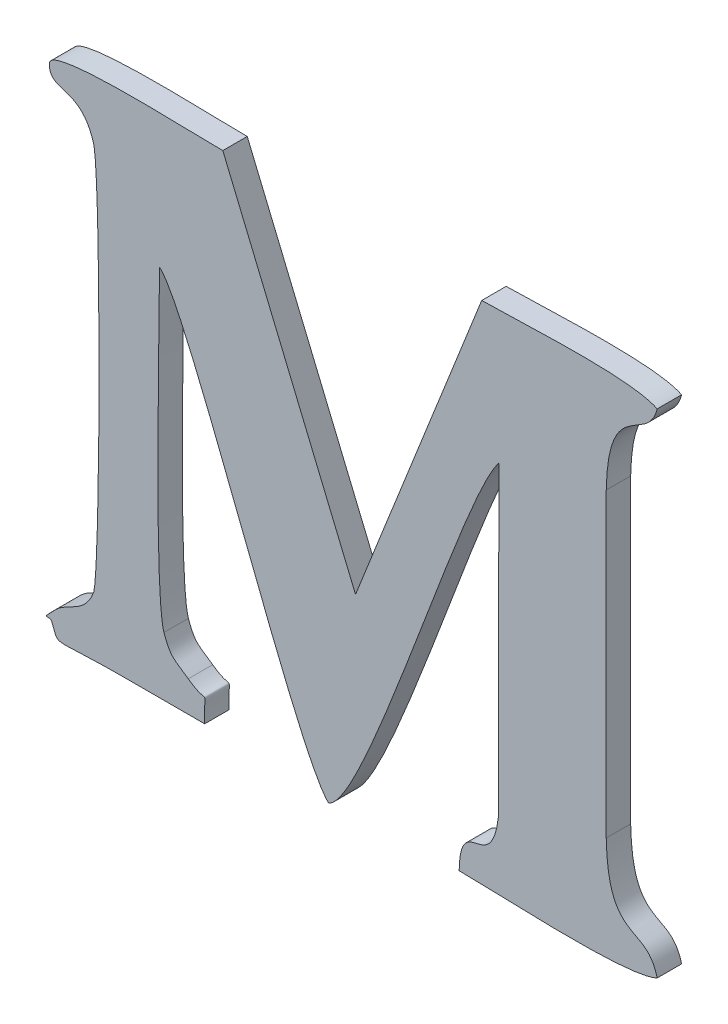
ISO-10303-21;
HEADER;
FILE_DESCRIPTION(('STEP AP214'),'2;1');
FILE_NAME('part.step','',(''),(''),'','','');
FILE_SCHEMA(('AUTOMOTIVE_DESIGN { 1 0 10303 214 1 1 1 1 }'));
ENDSEC;
DATA;
#1=APPLICATION_CONTEXT('core data for automotive mechanical design processes');
#2=APPLICATION_PROTOCOL_DEFINITION('international standard','automotive_design',2000,#1);
#3=PRODUCT_CONTEXT('',#1,'mechanical');
#4=PRODUCT('Part','Part','',(#3));
#5=PRODUCT_RELATED_PRODUCT_CATEGORY('part','',(#4));
#6=PRODUCT_DEFINITION_FORMATION('','',#4);
#7=PRODUCT_DEFINITION_CONTEXT('part definition',#1,'design');
#8=PRODUCT_DEFINITION('design','',#6,#7);
#9=PRODUCT_DEFINITION_SHAPE('','',#8);
#10=(LENGTH_UNIT() NAMED_UNIT(*) SI_UNIT(.MILLI.,.METRE.));
#11=(NAMED_UNIT(*) PLANE_ANGLE_UNIT() SI_UNIT($,.RADIAN.));
#12=(NAMED_UNIT(*) SI_UNIT($,.STERADIAN.) SOLID_ANGLE_UNIT());
#13=UNCERTAINTY_MEASURE_WITH_UNIT(LENGTH_MEASURE(1.E-05),#10,'distance_accuracy_value','');
#14=(GEOMETRIC_REPRESENTATION_CONTEXT(3) GLOBAL_UNCERTAINTY_ASSIGNED_CONTEXT((#13)) GLOBAL_UNIT_ASSIGNED_CONTEXT((#10,
#11,#12)) REPRESENTATION_CONTEXT('',''));
#15=CARTESIAN_POINT('',(0.,0.,0.));
#16=DIRECTION('',(0.,0.,1.));
#17=DIRECTION('',(1.,0.,0.));
#18=AXIS2_PLACEMENT_3D('',#15,#16,#17);
#19=CARTESIAN_POINT('',(50.2264099999998,11.201627,0.001));
#20=CARTESIAN_POINT('',(50.2264099999998,11.201627,0.));
#21=CARTESIAN_POINT('',(50.2260739999998,11.200689,0.001));
#22=CARTESIAN_POINT('',(50.2260739999998,11.200689,0.));
#23=CARTESIAN_POINT('',(50.2253459999998,11.200731,0.001));
#24=CARTESIAN_POINT('',(50.2253459999998,11.200731,0.));
#25=CARTESIAN_POINT('',(50.2248839999998,11.200269,0.001));
#26=CARTESIAN_POINT('',(50.2248839999998,11.200269,0.));
#27=B_SPLINE_SURFACE_WITH_KNOTS('',3,1,((#19,#20),(#21,#22),(#23,#24),(#25,#26)),.UNSPECIFIED.,
.F.,.F.,.F.,(4,4),(2,2),(0.863636363636364,0.909090909090909),(0.,1.),.UNSPECIFIED.);
#28=CARTESIAN_POINT('',(50.2264099999998,11.201627,0.));
#29=CARTESIAN_POINT('',(50.2260739999998,11.200689,0.));
#30=CARTESIAN_POINT('',(50.2253459999998,11.200731,0.));
#31=CARTESIAN_POINT('',(50.2248839999998,11.200269,0.));
#32=B_SPLINE_CURVE_WITH_KNOTS('',3,(#28,#29,#30,#31),.UNSPECIFIED.,.F.,.F.,(4,4),
(0.863636363636364,0.909090909090909),.UNSPECIFIED.);
#33=CARTESIAN_POINT('',(50.2264099999998,11.201627,0.));
#34=VERTEX_POINT('',#33);
#35=CARTESIAN_POINT('',(50.2248839999998,11.200269,0.));
#36=VERTEX_POINT('',#35);
#37=EDGE_CURVE('E11',#34,#36,#32,.T.);
#38=DIRECTION('',(0.,0.,-1.));
#39=VECTOR('',#38,1.);
#40=CARTESIAN_POINT('',(50.2248839999998,11.200269,0.001));
#41=LINE('',#40,#39);
#42=CARTESIAN_POINT('',(50.2248839999998,11.200269,0.001));
#43=VERTEX_POINT('',#42);
#44=EDGE_CURVE('E28',#43,#36,#41,.T.);
#45=CARTESIAN_POINT('',(50.2264099999998,11.201627,0.001));
#46=CARTESIAN_POINT('',(50.2260739999998,11.200689,0.001));
#47=CARTESIAN_POINT('',(50.2253459999998,11.200731,0.001));
#48=CARTESIAN_POINT('',(50.2248839999998,11.200269,0.001));
#49=B_SPLINE_CURVE_WITH_KNOTS('',3,(#45,#46,#47,#48),.UNSPECIFIED.,.F.,.F.,(4,4),
(0.863636363636364,0.909090909090909),.UNSPECIFIED.);
#50=CARTESIAN_POINT('',(50.2264099999998,11.201627,0.001));
#51=VERTEX_POINT('',#50);
#52=EDGE_CURVE('E477',#51,#43,#49,.T.);
#53=DIRECTION('',(0.,0.,-1.));
#54=VECTOR('',#53,1.);
#55=CARTESIAN_POINT('',(50.2264099999998,11.201627,0.001));
#56=LINE('',#55,#54);
#57=EDGE_CURVE('E40',#51,#34,#56,.T.);
#58=ORIENTED_EDGE('',*,*,#37,.T.);
#59=ORIENTED_EDGE('',*,*,#44,.F.);
#60=ORIENTED_EDGE('',*,*,#52,.F.);
#61=ORIENTED_EDGE('',*,*,#57,.T.);
#62=EDGE_LOOP('',(#58,#59,#60,#61));
#63=FACE_BOUND('',#62,.T.);
#64=ADVANCED_FACE('F17',(#63),#27,.F.);
#65=CARTESIAN_POINT('',(50.2248839999998,11.200269,0.001));
#66=CARTESIAN_POINT('',(50.2248839999998,11.200269,0.));
#67=CARTESIAN_POINT('',(50.2241559999998,11.199555,0.001));
#68=CARTESIAN_POINT('',(50.2241559999998,11.199555,0.));
#69=CARTESIAN_POINT('',(50.2246179999998,11.199961,0.001));
#70=CARTESIAN_POINT('',(50.2246179999998,11.199961,0.));
#71=CARTESIAN_POINT('',(50.2247019999998,11.199737,0.001));
#72=CARTESIAN_POINT('',(50.2247019999998,11.199737,0.));
#73=B_SPLINE_SURFACE_WITH_KNOTS('',3,1,((#65,#66),(#67,#68),(#69,#70),(#71,#72)),.UNSPECIFIED.,
.F.,.F.,.F.,(4,4),(2,2),(0.909090909090909,1.),(0.,1.),.UNSPECIFIED.);
#74=CARTESIAN_POINT('',(50.2248839999998,11.200269,0.));
#75=CARTESIAN_POINT('',(50.2241559999998,11.199555,0.));
#76=CARTESIAN_POINT('',(50.2246179999998,11.199961,0.));
#77=CARTESIAN_POINT('',(50.2247019999998,11.199737,0.));
#78=B_SPLINE_CURVE_WITH_KNOTS('',3,(#74,#75,#76,#77),.UNSPECIFIED.,.F.,.F.,(4,4),
(0.909090909090909,1.),.UNSPECIFIED.);
#79=CARTESIAN_POINT('',(50.2247019999998,11.199737,0.));
#80=VERTEX_POINT('',#79);
#81=EDGE_CURVE('E469',#36,#80,#78,.T.);
#82=DIRECTION('',(0.,0.,-1.));
#83=VECTOR('',#82,1.);
#84=CARTESIAN_POINT('',(50.2247019999998,11.199737,0.001));
#85=LINE('',#84,#83);
#86=CARTESIAN_POINT('',(50.2247019999998,11.199737,0.001));
#87=VERTEX_POINT('',#86);
#88=EDGE_CURVE('E464',#87,#80,#85,.T.);
#89=CARTESIAN_POINT('',(50.2248839999998,11.200269,0.001));
#90=CARTESIAN_POINT('',(50.2241559999998,11.199555,0.001));
#91=CARTESIAN_POINT('',(50.2246179999998,11.199961,0.001));
#92=CARTESIAN_POINT('',(50.2247019999998,11.199737,0.001));
#93=B_SPLINE_CURVE_WITH_KNOTS('',3,(#89,#90,#91,#92),.UNSPECIFIED.,.F.,.F.,(4,4),
(0.909090909090909,1.),.UNSPECIFIED.);
#94=EDGE_CURVE('E457',#43,#87,#93,.T.);
#95=ORIENTED_EDGE('',*,*,#81,.T.);
#96=ORIENTED_EDGE('',*,*,#88,.F.);
#97=ORIENTED_EDGE('',*,*,#94,.F.);
#98=ORIENTED_EDGE('',*,*,#44,.T.);
#99=EDGE_LOOP('',(#95,#96,#97,#98));
#100=FACE_BOUND('',#99,.T.);
#101=ADVANCED_FACE('F485',(#100),#73,.F.);
#102=CARTESIAN_POINT('',(50.2247019999998,11.199737,0.001));
#103=CARTESIAN_POINT('',(50.2247019999998,11.199737,0.));
#104=CARTESIAN_POINT('',(50.2250239999998,11.198939,0.001));
#105=CARTESIAN_POINT('',(50.2250239999998,11.198939,0.));
#106=CARTESIAN_POINT('',(50.2246319999998,11.199233,0.001));
#107=CARTESIAN_POINT('',(50.2246319999998,11.199233,0.));
#108=CARTESIAN_POINT('',(50.2274879999998,11.199247,0.001));
#109=CARTESIAN_POINT('',(50.2274879999998,11.199247,0.));
#110=B_SPLINE_SURFACE_WITH_KNOTS('',3,1,((#102,#103),(#104,#105),(#106,#107),(#108,#109)),
.UNSPECIFIED.,.F.,.F.,.F.,(4,4),(2,2),(0.,0.0454545454545455),(0.,1.),.UNSPECIFIED.);
#111=CARTESIAN_POINT('',(50.2247019999998,11.199737,0.));
#112=CARTESIAN_POINT('',(50.2250239999998,11.198939,0.));
#113=CARTESIAN_POINT('',(50.2246319999998,11.199233,0.));
#114=CARTESIAN_POINT('',(50.2274879999998,11.199247,0.));
#115=B_SPLINE_CURVE_WITH_KNOTS('',3,(#111,#112,#113,#114),.UNSPECIFIED.,.F.,.F.,(4,4),(0.,
0.0454545454545455),.UNSPECIFIED.);
#116=CARTESIAN_POINT('',(50.2274879999998,11.199247,0.));
#117=VERTEX_POINT('',#116);
#118=EDGE_CURVE('E452',#80,#117,#115,.T.);
#119=DIRECTION('',(0.,0.,-1.));
#120=VECTOR('',#119,1.);
#121=CARTESIAN_POINT('',(50.2274879999998,11.199247,0.001));
#122=LINE('',#121,#120);
#123=CARTESIAN_POINT('',(50.2274879999998,11.199247,0.001));
#124=VERTEX_POINT('',#123);
#125=EDGE_CURVE('E447',#124,#117,#122,.T.);
#126=CARTESIAN_POINT('',(50.2247019999998,11.199737,0.001));
#127=CARTESIAN_POINT('',(50.2250239999998,11.198939,0.001));
#128=CARTESIAN_POINT('',(50.2246319999998,11.199233,0.001));
#129=CARTESIAN_POINT('',(50.2274879999998,11.199247,0.001));
#130=B_SPLINE_CURVE_WITH_KNOTS('',3,(#126,#127,#128,#129),.UNSPECIFIED.,.F.,.F.,(4,4),(0.,
0.0454545454545455),.UNSPECIFIED.);
#131=EDGE_CURVE('E440',#87,#124,#130,.T.);
#132=ORIENTED_EDGE('',*,*,#118,.T.);
#133=ORIENTED_EDGE('',*,*,#125,.F.);
#134=ORIENTED_EDGE('',*,*,#131,.F.);
#135=ORIENTED_EDGE('',*,*,#88,.T.);
#136=EDGE_LOOP('',(#132,#133,#134,#135));
#137=FACE_BOUND('',#136,.T.);
#138=ADVANCED_FACE('F490',(#137),#110,.F.);
#139=CARTESIAN_POINT('',(50.2274879999998,11.199247,0.001));
#140=CARTESIAN_POINT('',(50.2274879999998,11.199247,0.));
#141=CARTESIAN_POINT('',(50.2286359999998,11.199261,0.001));
#142=CARTESIAN_POINT('',(50.2286359999998,11.199261,0.));
#143=CARTESIAN_POINT('',(50.2297979999998,11.199247,0.001));
#144=CARTESIAN_POINT('',(50.2297979999998,11.199247,0.));
#145=CARTESIAN_POINT('',(50.2309599999998,11.199247,0.001));
#146=CARTESIAN_POINT('',(50.2309599999998,11.199247,0.));
#147=B_SPLINE_SURFACE_WITH_KNOTS('',3,1,((#139,#140),(#141,#142),(#143,#144),(#145,#146)),
.UNSPECIFIED.,.F.,.F.,.F.,(4,4),(2,2),(0.0454545454545455,0.0909090909090909),(0.,1.),.UNSPECIFIED.);
#148=CARTESIAN_POINT('',(50.2274879999998,11.199247,0.));
#149=CARTESIAN_POINT('',(50.2286359999998,11.199261,0.));
#150=CARTESIAN_POINT('',(50.2297979999998,11.199247,0.));
#151=CARTESIAN_POINT('',(50.2309599999998,11.199247,0.));
#152=B_SPLINE_CURVE_WITH_KNOTS('',3,(#148,#149,#150,#151),.UNSPECIFIED.,.F.,.F.,(4,4),
(0.0454545454545455,0.0909090909090909),.UNSPECIFIED.);
#153=CARTESIAN_POINT('',(50.2309599999998,11.199247,0.));
#154=VERTEX_POINT('',#153);
#155=EDGE_CURVE('E435',#117,#154,#152,.T.);
#156=DIRECTION('',(0.,0.,-1.));
#157=VECTOR('',#156,1.);
#158=CARTESIAN_POINT('',(50.2309599999998,11.199247,0.001));
#159=LINE('',#158,#157);
#160=CARTESIAN_POINT('',(50.2309599999998,11.199247,0.001));
#161=VERTEX_POINT('',#160);
#162=EDGE_CURVE('E430',#161,#154,#159,.T.);
#163=CARTESIAN_POINT('',(50.2274879999998,11.199247,0.001));
#164=CARTESIAN_POINT('',(50.2286359999998,11.199261,0.001));
#165=CARTESIAN_POINT('',(50.2297979999998,11.199247,0.001));
#166=CARTESIAN_POINT('',(50.2309599999998,11.199247,0.001));
#167=B_SPLINE_CURVE_WITH_KNOTS('',3,(#163,#164,#165,#166),.UNSPECIFIED.,.F.,.F.,(4,4),
(0.0454545454545455,0.0909090909090909),.UNSPECIFIED.);
#168=EDGE_CURVE('E423',#124,#161,#167,.T.);
#169=ORIENTED_EDGE('',*,*,#155,.T.);
#170=ORIENTED_EDGE('',*,*,#162,.F.);
#171=ORIENTED_EDGE('',*,*,#168,.F.);
#172=ORIENTED_EDGE('',*,*,#125,.T.);
#173=EDGE_LOOP('',(#169,#170,#171,#172));
#174=FACE_BOUND('',#173,.T.);
#175=ADVANCED_FACE('F496',(#174),#147,.F.);
#176=CARTESIAN_POINT('',(50.2309599999998,11.199247,0.001));
#177=CARTESIAN_POINT('',(50.2309599999998,11.199247,0.));
#178=CARTESIAN_POINT('',(50.2309179999998,11.200717,0.001));
#179=CARTESIAN_POINT('',(50.2309179999998,11.200717,0.));
#180=CARTESIAN_POINT('',(50.2311979999998,11.199849,0.001));
#181=CARTESIAN_POINT('',(50.2311979999998,11.199849,0.));
#182=CARTESIAN_POINT('',(50.2302879999998,11.200507,0.001));
#183=CARTESIAN_POINT('',(50.2302879999998,11.200507,0.));
#184=B_SPLINE_SURFACE_WITH_KNOTS('',3,1,((#176,#177),(#178,#179),(#180,#181),(#182,#183)),
.UNSPECIFIED.,.F.,.F.,.F.,(4,4),(2,2),(0.0909090909090909,0.136363636363636),(0.,1.),.UNSPECIFIED.);
#185=CARTESIAN_POINT('',(50.2309599999998,11.199247,0.));
#186=CARTESIAN_POINT('',(50.2309179999998,11.200717,0.));
#187=CARTESIAN_POINT('',(50.2311979999998,11.199849,0.));
#188=CARTESIAN_POINT('',(50.2302879999998,11.200507,0.));
#189=B_SPLINE_CURVE_WITH_KNOTS('',3,(#185,#186,#187,#188),.UNSPECIFIED.,.F.,.F.,(4,4),
(0.0909090909090909,0.136363636363636),.UNSPECIFIED.);
#190=CARTESIAN_POINT('',(50.2302879999998,11.200507,0.));
#191=VERTEX_POINT('',#190);
#192=EDGE_CURVE('E418',#154,#191,#189,.T.);
#193=DIRECTION('',(0.,0.,-1.));
#194=VECTOR('',#193,1.);
#195=CARTESIAN_POINT('',(50.2302879999998,11.200507,0.001));
#196=LINE('',#195,#194);
#197=CARTESIAN_POINT('',(50.2302879999998,11.200507,0.001));
#198=VERTEX_POINT('',#197);
#199=EDGE_CURVE('E413',#198,#191,#196,.T.);
#200=CARTESIAN_POINT('',(50.2309599999998,11.199247,0.001));
#201=CARTESIAN_POINT('',(50.2309179999998,11.200717,0.001));
#202=CARTESIAN_POINT('',(50.2311979999998,11.199849,0.001));
#203=CARTESIAN_POINT('',(50.2302879999998,11.200507,0.001));
#204=B_SPLINE_CURVE_WITH_KNOTS('',3,(#200,#201,#202,#203),.UNSPECIFIED.,.F.,.F.,(4,4),
(0.0909090909090909,0.136363636363636),.UNSPECIFIED.);
#205=EDGE_CURVE('E406',#161,#198,#204,.T.);
#206=ORIENTED_EDGE('',*,*,#192,.T.);
#207=ORIENTED_EDGE('',*,*,#199,.F.);
#208=ORIENTED_EDGE('',*,*,#205,.F.);
#209=ORIENTED_EDGE('',*,*,#162,.T.);
#210=EDGE_LOOP('',(#206,#207,#208,#209));
#211=FACE_BOUND('',#210,.T.);
#212=ADVANCED_FACE('F500',(#211),#184,.F.);
#213=CARTESIAN_POINT('',(50.2302879999998,11.200507,0.001));
#214=CARTESIAN_POINT('',(50.2302879999998,11.200507,0.));
#215=CARTESIAN_POINT('',(50.2297279999998,11.200913,0.001));
#216=CARTESIAN_POINT('',(50.2297279999998,11.200913,0.));
#217=CARTESIAN_POINT('',(50.2295599999998,11.200885,0.001));
#218=CARTESIAN_POINT('',(50.2295599999998,11.200885,0.));
#219=CARTESIAN_POINT('',(50.2292939999998,11.201655,0.001));
#220=CARTESIAN_POINT('',(50.2292939999998,11.201655,0.));
#221=B_SPLINE_SURFACE_WITH_KNOTS('',3,1,((#213,#214),(#215,#216),(#217,#218),(#219,#220)),
.UNSPECIFIED.,.F.,.F.,.F.,(4,4),(2,2),(0.136363636363636,0.181818181818182),(0.,1.),.UNSPECIFIED.);
#222=CARTESIAN_POINT('',(50.2302879999998,11.200507,0.));
#223=CARTESIAN_POINT('',(50.2297279999998,11.200913,0.));
#224=CARTESIAN_POINT('',(50.2295599999998,11.200885,0.));
#225=CARTESIAN_POINT('',(50.2292939999998,11.201655,0.));
#226=B_SPLINE_CURVE_WITH_KNOTS('',3,(#222,#223,#224,#225),.UNSPECIFIED.,.F.,.F.,(4,4),
(0.136363636363636,0.181818181818182),.UNSPECIFIED.);
#227=CARTESIAN_POINT('',(50.2292939999998,11.201655,0.));
#228=VERTEX_POINT('',#227);
#229=EDGE_CURVE('E401',#191,#228,#226,.T.);
#230=DIRECTION('',(0.,0.,-1.));
#231=VECTOR('',#230,1.);
#232=CARTESIAN_POINT('',(50.2292939999998,11.201655,0.001));
#233=LINE('',#232,#231);
#234=CARTESIAN_POINT('',(50.2292939999998,11.201655,0.001));
#235=VERTEX_POINT('',#234);
#236=EDGE_CURVE('E396',#235,#228,#233,.T.);
#237=CARTESIAN_POINT('',(50.2302879999998,11.200507,0.001));
#238=CARTESIAN_POINT('',(50.2297279999998,11.200913,0.001));
#239=CARTESIAN_POINT('',(50.2295599999998,11.200885,0.001));
#240=CARTESIAN_POINT('',(50.2292939999998,11.201655,0.001));
#241=B_SPLINE_CURVE_WITH_KNOTS('',3,(#237,#238,#239,#240),.UNSPECIFIED.,.F.,.F.,(4,4),
(0.136363636363636,0.181818181818182),.UNSPECIFIED.);
#242=EDGE_CURVE('E389',#198,#235,#241,.T.);
#243=ORIENTED_EDGE('',*,*,#229,.T.);
#244=ORIENTED_EDGE('',*,*,#236,.F.);
#245=ORIENTED_EDGE('',*,*,#242,.F.);
#246=ORIENTED_EDGE('',*,*,#199,.T.);
#247=EDGE_LOOP('',(#243,#244,#245,#246));
#248=FACE_BOUND('',#247,.T.);
#249=ADVANCED_FACE('F505',(#248),#221,.F.);
#250=CARTESIAN_POINT('',(50.2292939999998,11.201655,0.001));
#251=CARTESIAN_POINT('',(50.2292939999998,11.201655,0.));
#252=CARTESIAN_POINT('',(50.2288739999998,11.202859,0.001));
#253=CARTESIAN_POINT('',(50.2288739999998,11.202859,0.));
#254=CARTESIAN_POINT('',(50.2291119999998,11.212771,0.001));
#255=CARTESIAN_POINT('',(50.2291119999998,11.212771,0.));
#256=CARTESIAN_POINT('',(50.2291119999998,11.214507,0.001));
#257=CARTESIAN_POINT('',(50.2291119999998,11.214507,0.));
#258=B_SPLINE_SURFACE_WITH_KNOTS('',3,1,((#250,#251),(#252,#253),(#254,#255),(#256,#257)),
.UNSPECIFIED.,.F.,.F.,.F.,(4,4),(2,2),(0.181818181818182,0.227272727272727),(0.,1.),.UNSPECIFIED.);
#259=CARTESIAN_POINT('',(50.2292939999998,11.201655,0.));
#260=CARTESIAN_POINT('',(50.2288739999998,11.202859,0.));
#261=CARTESIAN_POINT('',(50.2291119999998,11.212771,0.));
#262=CARTESIAN_POINT('',(50.2291119999998,11.214507,0.));
#263=B_SPLINE_CURVE_WITH_KNOTS('',3,(#259,#260,#261,#262),.UNSPECIFIED.,.F.,.F.,(4,4),
(0.181818181818182,0.227272727272727),.UNSPECIFIED.);
#264=CARTESIAN_POINT('',(50.2291119999998,11.214507,0.));
#265=VERTEX_POINT('',#264);
#266=EDGE_CURVE('E384',#228,#265,#263,.T.);
#267=DIRECTION('',(0.,0.,-1.));
#268=VECTOR('',#267,1.);
#269=CARTESIAN_POINT('',(50.2291119999998,11.214507,0.001));
#270=LINE('',#269,#268);
#271=CARTESIAN_POINT('',(50.2291119999998,11.214507,0.001));
#272=VERTEX_POINT('',#271);
#273=EDGE_CURVE('E379',#272,#265,#270,.T.);
#274=CARTESIAN_POINT('',(50.2292939999998,11.201655,0.001));
#275=CARTESIAN_POINT('',(50.2288739999998,11.202859,0.001));
#276=CARTESIAN_POINT('',(50.2291119999998,11.212771,0.001));
#277=CARTESIAN_POINT('',(50.2291119999998,11.214507,0.001));
#278=B_SPLINE_CURVE_WITH_KNOTS('',3,(#274,#275,#276,#277),.UNSPECIFIED.,.F.,.F.,(4,4),
(0.181818181818182,0.227272727272727),.UNSPECIFIED.);
#279=EDGE_CURVE('E372',#235,#272,#278,.T.);
#280=ORIENTED_EDGE('',*,*,#266,.T.);
#281=ORIENTED_EDGE('',*,*,#273,.F.);
#282=ORIENTED_EDGE('',*,*,#279,.F.);
#283=ORIENTED_EDGE('',*,*,#236,.T.);
#284=EDGE_LOOP('',(#280,#281,#282,#283));
#285=FACE_BOUND('',#284,.T.);
#286=ADVANCED_FACE('F511',(#285),#258,.F.);
#287=CARTESIAN_POINT('',(50.2291119999998,11.214507,0.001));
#288=CARTESIAN_POINT('',(50.2291119999998,11.214507,0.));
#289=CARTESIAN_POINT('',(50.2303019999998,11.213597,0.001));
#290=CARTESIAN_POINT('',(50.2303019999998,11.213597,0.));
#291=CARTESIAN_POINT('',(50.2346979999998,11.200157,0.001));
#292=CARTESIAN_POINT('',(50.2346979999998,11.200157,0.));
#293=CARTESIAN_POINT('',(50.2360279999998,11.198981,0.001));
#294=CARTESIAN_POINT('',(50.2360279999998,11.198981,0.));
#295=B_SPLINE_SURFACE_WITH_KNOTS('',3,1,((#287,#288),(#289,#290),(#291,#292),(#293,#294)),
.UNSPECIFIED.,.F.,.F.,.F.,(4,4),(2,2),(0.227272727272727,0.272727272727273),(0.,1.),.UNSPECIFIED.);
#296=CARTESIAN_POINT('',(50.2291119999998,11.214507,0.));
#297=CARTESIAN_POINT('',(50.2303019999998,11.213597,0.));
#298=CARTESIAN_POINT('',(50.2346979999998,11.200157,0.));
#299=CARTESIAN_POINT('',(50.2360279999998,11.198981,0.));
#300=B_SPLINE_CURVE_WITH_KNOTS('',3,(#296,#297,#298,#299),.UNSPECIFIED.,.F.,.F.,(4,4),
(0.227272727272727,0.272727272727273),.UNSPECIFIED.);
#301=CARTESIAN_POINT('',(50.2360279999998,11.198981,0.));
#302=VERTEX_POINT('',#301);
#303=EDGE_CURVE('E367',#265,#302,#300,.T.);
#304=DIRECTION('',(0.,0.,-1.));
#305=VECTOR('',#304,1.);
#306=CARTESIAN_POINT('',(50.2360279999998,11.198981,0.001));
#307=LINE('',#306,#305);
#308=CARTESIAN_POINT('',(50.2360279999998,11.198981,0.001));
#309=VERTEX_POINT('',#308);
#310=EDGE_CURVE('E362',#309,#302,#307,.T.);
#311=CARTESIAN_POINT('',(50.2291119999998,11.214507,0.001));
#312=CARTESIAN_POINT('',(50.2303019999998,11.213597,0.001));
#313=CARTESIAN_POINT('',(50.2346979999998,11.200157,0.001));
#314=CARTESIAN_POINT('',(50.2360279999998,11.198981,0.001));
#315=B_SPLINE_CURVE_WITH_KNOTS('',3,(#311,#312,#313,#314),.UNSPECIFIED.,.F.,.F.,(4,4),
(0.227272727272727,0.272727272727273),.UNSPECIFIED.);
#316=EDGE_CURVE('E355',#272,#309,#315,.T.);
#317=ORIENTED_EDGE('',*,*,#303,.T.);
#318=ORIENTED_EDGE('',*,*,#310,.F.);
#319=ORIENTED_EDGE('',*,*,#316,.F.);
#320=ORIENTED_EDGE('',*,*,#273,.T.);
#321=EDGE_LOOP('',(#317,#318,#319,#320));
#322=FACE_BOUND('',#321,.T.);
#323=ADVANCED_FACE('F515',(#322),#295,.F.);
#324=CARTESIAN_POINT('',(50.2360279999998,11.198981,0.001));
#325=CARTESIAN_POINT('',(50.2360279999998,11.198981,0.));
#326=CARTESIAN_POINT('',(50.2374979999998,11.199471,0.001));
#327=CARTESIAN_POINT('',(50.2374979999998,11.199471,0.));
#328=CARTESIAN_POINT('',(50.2415439999998,11.212757,0.001));
#329=CARTESIAN_POINT('',(50.2415439999998,11.212757,0.));
#330=CARTESIAN_POINT('',(50.2429999999998,11.214507,0.001));
#331=CARTESIAN_POINT('',(50.2429999999998,11.214507,0.));
#332=B_SPLINE_SURFACE_WITH_KNOTS('',3,1,((#324,#325),(#326,#327),(#328,#329),(#330,#331)),
.UNSPECIFIED.,.F.,.F.,.F.,(4,4),(2,2),(0.272727272727273,0.318181818181818),(0.,1.),.UNSPECIFIED.);
#333=CARTESIAN_POINT('',(50.2360279999998,11.198981,0.));
#334=CARTESIAN_POINT('',(50.2374979999998,11.199471,0.));
#335=CARTESIAN_POINT('',(50.2415439999998,11.212757,0.));
#336=CARTESIAN_POINT('',(50.2429999999998,11.214507,0.));
#337=B_SPLINE_CURVE_WITH_KNOTS('',3,(#333,#334,#335,#336),.UNSPECIFIED.,.F.,.F.,(4,4),
(0.272727272727273,0.318181818181818),.UNSPECIFIED.);
#338=CARTESIAN_POINT('',(50.2429999999998,11.214507,0.));
#339=VERTEX_POINT('',#338);
#340=EDGE_CURVE('E350',#302,#339,#337,.T.);
#341=DIRECTION('',(0.,0.,-1.));
#342=VECTOR('',#341,1.);
#343=CARTESIAN_POINT('',(50.2429999999998,11.214507,0.001));
#344=LINE('',#343,#342);
#345=CARTESIAN_POINT('',(50.2429999999998,11.214507,0.001));
#346=VERTEX_POINT('',#345);
#347=EDGE_CURVE('E345',#346,#339,#344,.T.);
#348=CARTESIAN_POINT('',(50.2360279999998,11.198981,0.001));
#349=CARTESIAN_POINT('',(50.2374979999998,11.199471,0.001));
#350=CARTESIAN_POINT('',(50.2415439999998,11.212757,0.001));
#351=CARTESIAN_POINT('',(50.2429999999998,11.214507,0.001));
#352=B_SPLINE_CURVE_WITH_KNOTS('',3,(#348,#349,#350,#351),.UNSPECIFIED.,.F.,.F.,(4,4),
(0.272727272727273,0.318181818181818),.UNSPECIFIED.);
#353=EDGE_CURVE('E341',#309,#346,#352,.T.);
#354=ORIENTED_EDGE('',*,*,#340,.T.);
#355=ORIENTED_EDGE('',*,*,#347,.F.);
#356=ORIENTED_EDGE('',*,*,#353,.F.);
#357=ORIENTED_EDGE('',*,*,#310,.T.);
#358=EDGE_LOOP('',(#354,#355,#356,#357));
#359=FACE_BOUND('',#358,.T.);
#360=ADVANCED_FACE('F520',(#359),#332,.F.);
#361=CARTESIAN_POINT('',(50.2304071169103,-0.0561233599332541,0.001));
#362=DIRECTION('',(0.99999937580034,-0.0011173177388438,0.));
#363=DIRECTION('',(0.0011173177388438,0.99999937580034,0.));
#364=AXIS2_PLACEMENT_3D('',#361,#362,#363);
#365=PLANE('',#364);
#366=DIRECTION('',(-0.0011173177388438,-0.99999937580034,0.));
#367=VECTOR('',#366,1.);
#368=CARTESIAN_POINT('',(50.2304071169103,-0.0561233599332541,0.));
#369=LINE('',#368,#367);
#370=CARTESIAN_POINT('',(50.2429859999998,11.201977,0.));
#371=VERTEX_POINT('',#370);
#372=EDGE_CURVE('E339',#339,#371,#369,.T.);
#373=ORIENTED_EDGE('',*,*,#372,.T.);
#374=DIRECTION('',(0.,0.,-1.));
#375=VECTOR('',#374,1.);
#376=CARTESIAN_POINT('',(50.2429859999998,11.201977,0.001));
#377=LINE('',#376,#375);
#378=CARTESIAN_POINT('',(50.2429859999998,11.201977,0.001));
#379=VERTEX_POINT('',#378);
#380=EDGE_CURVE('E336',#379,#371,#377,.T.);
#381=ORIENTED_EDGE('',*,*,#380,.F.);
#382=DIRECTION('',(-0.0011173177388438,-0.99999937580034,0.));
#383=VECTOR('',#382,1.);
#384=CARTESIAN_POINT('',(50.2304071169103,-0.0561233599332541,0.001));
#385=LINE('',#384,#383);
#386=EDGE_CURVE('E330',#346,#379,#385,.T.);
#387=ORIENTED_EDGE('',*,*,#386,.F.);
#388=ORIENTED_EDGE('',*,*,#347,.T.);
#389=EDGE_LOOP('',(#373,#381,#387,#388));
#390=FACE_BOUND('',#389,.T.);
#391=ADVANCED_FACE('F565',(#390),#365,.F.);
#392=CARTESIAN_POINT('',(50.2429859999998,11.201977,0.001));
#393=CARTESIAN_POINT('',(50.2429859999998,11.201977,0.));
#394=CARTESIAN_POINT('',(50.2426919999998,11.199527,0.001));
#395=CARTESIAN_POINT('',(50.2426919999998,11.199527,0.));
#396=CARTESIAN_POINT('',(50.2414179999998,11.201585,0.001));
#397=CARTESIAN_POINT('',(50.2414179999998,11.201585,0.));
#398=CARTESIAN_POINT('',(50.2413759999998,11.199247,0.001));
#399=CARTESIAN_POINT('',(50.2413759999998,11.199247,0.));
#400=B_SPLINE_SURFACE_WITH_KNOTS('',3,1,((#392,#393),(#394,#395),(#396,#397),(#398,#399)),
.UNSPECIFIED.,.F.,.F.,.F.,(4,4),(2,2),(0.363636363636364,0.409090909090909),(0.,1.),.UNSPECIFIED.);
#401=CARTESIAN_POINT('',(50.2429859999998,11.201977,0.));
#402=CARTESIAN_POINT('',(50.2426919999998,11.199527,0.));
#403=CARTESIAN_POINT('',(50.2414179999998,11.201585,0.));
#404=CARTESIAN_POINT('',(50.2413759999998,11.199247,0.));
#405=B_SPLINE_CURVE_WITH_KNOTS('',3,(#401,#402,#403,#404),.UNSPECIFIED.,.F.,.F.,(4,4),
(0.363636363636364,0.409090909090909),.UNSPECIFIED.);
#406=CARTESIAN_POINT('',(50.2413759999998,11.199247,0.));
#407=VERTEX_POINT('',#406);
#408=EDGE_CURVE('E325',#371,#407,#405,.T.);
#409=DIRECTION('',(0.,0.,-1.));
#410=VECTOR('',#409,1.);
#411=CARTESIAN_POINT('',(50.2413759999998,11.199247,0.001));
#412=LINE('',#411,#410);
#413=CARTESIAN_POINT('',(50.2413759999998,11.199247,0.001));
#414=VERTEX_POINT('',#413);
#415=EDGE_CURVE('E320',#414,#407,#412,.T.);
#416=CARTESIAN_POINT('',(50.2429859999998,11.201977,0.001));
#417=CARTESIAN_POINT('',(50.2426919999998,11.199527,0.001));
#418=CARTESIAN_POINT('',(50.2414179999998,11.201585,0.001));
#419=CARTESIAN_POINT('',(50.2413759999998,11.199247,0.001));
#420=B_SPLINE_CURVE_WITH_KNOTS('',3,(#416,#417,#418,#419),.UNSPECIFIED.,.F.,.F.,(4,4),
(0.363636363636364,0.409090909090909),.UNSPECIFIED.);
#421=EDGE_CURVE('E313',#379,#414,#420,.T.);
#422=ORIENTED_EDGE('',*,*,#408,.T.);
#423=ORIENTED_EDGE('',*,*,#415,.F.);
#424=ORIENTED_EDGE('',*,*,#421,.F.);
#425=ORIENTED_EDGE('',*,*,#380,.T.);
#426=EDGE_LOOP('',(#422,#423,#424,#425));
#427=FACE_BOUND('',#426,.T.);
#428=ADVANCED_FACE('F526',(#427),#400,.F.);
#429=CARTESIAN_POINT('',(50.2413759999998,11.199247,0.001));
#430=CARTESIAN_POINT('',(50.2413759999998,11.199247,0.));
#431=CARTESIAN_POINT('',(50.2430839999998,11.199247,0.001));
#432=CARTESIAN_POINT('',(50.2430839999998,11.199247,0.));
#433=CARTESIAN_POINT('',(50.2482499999998,11.198897,0.001));
#434=CARTESIAN_POINT('',(50.2482499999998,11.198897,0.));
#435=CARTESIAN_POINT('',(50.2494819999998,11.199499,0.001));
#436=CARTESIAN_POINT('',(50.2494819999998,11.199499,0.));
#437=B_SPLINE_SURFACE_WITH_KNOTS('',3,1,((#429,#430),(#431,#432),(#433,#434),(#435,#436)),
.UNSPECIFIED.,.F.,.F.,.F.,(4,4),(2,2),(0.409090909090909,0.454545454545455),(0.,1.),.UNSPECIFIED.);
#438=CARTESIAN_POINT('',(50.2413759999998,11.199247,0.));
#439=CARTESIAN_POINT('',(50.2430839999998,11.199247,0.));
#440=CARTESIAN_POINT('',(50.2482499999998,11.198897,0.));
#441=CARTESIAN_POINT('',(50.2494819999998,11.199499,0.));
#442=B_SPLINE_CURVE_WITH_KNOTS('',3,(#438,#439,#440,#441),.UNSPECIFIED.,.F.,.F.,(4,4),
(0.409090909090909,0.454545454545455),.UNSPECIFIED.);
#443=CARTESIAN_POINT('',(50.2494819999998,11.199499,0.));
#444=VERTEX_POINT('',#443);
#445=EDGE_CURVE('E308',#407,#444,#442,.T.);
#446=DIRECTION('',(0.,0.,-1.));
#447=VECTOR('',#446,1.);
#448=CARTESIAN_POINT('',(50.2494819999998,11.199499,0.001));
#449=LINE('',#448,#447);
#450=CARTESIAN_POINT('',(50.2494819999998,11.199499,0.001));
#451=VERTEX_POINT('',#450);
#452=EDGE_CURVE('E303',#451,#444,#449,.T.);
#453=CARTESIAN_POINT('',(50.2413759999998,11.199247,0.001));
#454=CARTESIAN_POINT('',(50.2430839999998,11.199247,0.001));
#455=CARTESIAN_POINT('',(50.2482499999998,11.198897,0.001));
#456=CARTESIAN_POINT('',(50.2494819999998,11.199499,0.001));
#457=B_SPLINE_CURVE_WITH_KNOTS('',3,(#453,#454,#455,#456),.UNSPECIFIED.,.F.,.F.,(4,4),
(0.409090909090909,0.454545454545455),.UNSPECIFIED.);
#458=EDGE_CURVE('E296',#414,#451,#457,.T.);
#459=ORIENTED_EDGE('',*,*,#445,.T.);
#460=ORIENTED_EDGE('',*,*,#452,.F.);
#461=ORIENTED_EDGE('',*,*,#458,.F.);
#462=ORIENTED_EDGE('',*,*,#415,.T.);
#463=EDGE_LOOP('',(#459,#460,#461,#462));
#464=FACE_BOUND('',#463,.T.);
#465=ADVANCED_FACE('F532',(#464),#437,.F.);
#466=CARTESIAN_POINT('',(50.2494819999998,11.199499,0.001));
#467=CARTESIAN_POINT('',(50.2494819999998,11.199499,0.));
#468=CARTESIAN_POINT('',(50.2490339999998,11.201235,0.001));
#469=CARTESIAN_POINT('',(50.2490339999998,11.201235,0.));
#470=CARTESIAN_POINT('',(50.2474659999998,11.199751,0.001));
#471=CARTESIAN_POINT('',(50.2474659999998,11.199751,0.));
#472=CARTESIAN_POINT('',(50.2473959999998,11.203419,0.001));
#473=CARTESIAN_POINT('',(50.2473959999998,11.203419,0.));
#474=B_SPLINE_SURFACE_WITH_KNOTS('',3,1,((#466,#467),(#468,#469),(#470,#471),(#472,#473)),
.UNSPECIFIED.,.F.,.F.,.F.,(4,4),(2,2),(0.454545454545455,0.5),(0.,1.),.UNSPECIFIED.);
#475=CARTESIAN_POINT('',(50.2494819999998,11.199499,0.));
#476=CARTESIAN_POINT('',(50.2490339999998,11.201235,0.));
#477=CARTESIAN_POINT('',(50.2474659999998,11.199751,0.));
#478=CARTESIAN_POINT('',(50.2473959999998,11.203419,0.));
#479=B_SPLINE_CURVE_WITH_KNOTS('',3,(#475,#476,#477,#478),.UNSPECIFIED.,.F.,.F.,(4,4),
(0.454545454545455,0.5),.UNSPECIFIED.);
#480=CARTESIAN_POINT('',(50.2473959999998,11.203419,0.));
#481=VERTEX_POINT('',#480);
#482=EDGE_CURVE('E291',#444,#481,#479,.T.);
#483=DIRECTION('',(0.,0.,-1.));
#484=VECTOR('',#483,1.);
#485=CARTESIAN_POINT('',(50.2473959999998,11.203419,0.001));
#486=LINE('',#485,#484);
#487=CARTESIAN_POINT('',(50.2473959999998,11.203419,0.001));
#488=VERTEX_POINT('',#487);
#489=EDGE_CURVE('E286',#488,#481,#486,.T.);
#490=CARTESIAN_POINT('',(50.2494819999998,11.199499,0.001));
#491=CARTESIAN_POINT('',(50.2490339999998,11.201235,0.001));
#492=CARTESIAN_POINT('',(50.2474659999998,11.199751,0.001));
#493=CARTESIAN_POINT('',(50.2473959999998,11.203419,0.001));
#494=B_SPLINE_CURVE_WITH_KNOTS('',3,(#490,#491,#492,#493),.UNSPECIFIED.,.F.,.F.,(4,4),
(0.454545454545455,0.5),.UNSPECIFIED.);
#495=EDGE_CURVE('E282',#451,#488,#494,.T.);
#496=ORIENTED_EDGE('',*,*,#482,.T.);
#497=ORIENTED_EDGE('',*,*,#489,.F.);
#498=ORIENTED_EDGE('',*,*,#495,.F.);
#499=ORIENTED_EDGE('',*,*,#452,.T.);
#500=EDGE_LOOP('',(#496,#497,#498,#499));
#501=FACE_BOUND('',#500,.T.);
#502=ADVANCED_FACE('F538',(#501),#474,.F.);
#503=CARTESIAN_POINT('',(50.2473959999998,0.,0.001));
#504=DIRECTION('',(-1.,0.,0.));
#505=DIRECTION('',(0.,0.,1.));
#506=AXIS2_PLACEMENT_3D('',#503,#504,#505);
#507=PLANE('',#506);
#508=DIRECTION('',(0.,1.,0.));
#509=VECTOR('',#508,1.);
#510=CARTESIAN_POINT('',(50.2473959999998,0.,0.));
#511=LINE('',#510,#509);
#512=CARTESIAN_POINT('',(50.2473959999998,11.215753,0.));
#513=VERTEX_POINT('',#512);
#514=EDGE_CURVE('E280',#481,#513,#511,.T.);
#515=ORIENTED_EDGE('',*,*,#514,.T.);
#516=DIRECTION('',(0.,0.,-1.));
#517=VECTOR('',#516,1.);
#518=CARTESIAN_POINT('',(50.2473959999998,11.215753,0.001));
#519=LINE('',#518,#517);
#520=CARTESIAN_POINT('',(50.2473959999998,11.215753,0.001));
#521=VERTEX_POINT('',#520);
#522=EDGE_CURVE('E277',#521,#513,#519,.T.);
#523=ORIENTED_EDGE('',*,*,#522,.F.);
#524=DIRECTION('',(0.,1.,0.));
#525=VECTOR('',#524,1.);
#526=CARTESIAN_POINT('',(50.2473959999998,0.,0.001));
#527=LINE('',#526,#525);
#528=EDGE_CURVE('E271',#488,#521,#527,.T.);
#529=ORIENTED_EDGE('',*,*,#528,.F.);
#530=ORIENTED_EDGE('',*,*,#489,.T.);
#531=EDGE_LOOP('',(#515,#523,#529,#530));
#532=FACE_BOUND('',#531,.T.);
#533=ADVANCED_FACE('F542',(#532),#507,.F.);
#534=CARTESIAN_POINT('',(50.2473959999998,11.215753,0.001));
#535=CARTESIAN_POINT('',(50.2473959999998,11.215753,0.));
#536=CARTESIAN_POINT('',(50.2474659999998,11.219337,0.001));
#537=CARTESIAN_POINT('',(50.2474659999998,11.219337,0.));
#538=CARTESIAN_POINT('',(50.2490759999998,11.218105,0.001));
#539=CARTESIAN_POINT('',(50.2490759999998,11.218105,0.));
#540=CARTESIAN_POINT('',(50.2494819999998,11.219673,0.001));
#541=CARTESIAN_POINT('',(50.2494819999998,11.219673,0.));
#542=B_SPLINE_SURFACE_WITH_KNOTS('',3,1,((#534,#535),(#536,#537),(#538,#539),(#540,#541)),
.UNSPECIFIED.,.F.,.F.,.F.,(4,4),(2,2),(0.545454545454545,0.590909090909091),(0.,1.),.UNSPECIFIED.);
#543=CARTESIAN_POINT('',(50.2473959999998,11.215753,0.));
#544=CARTESIAN_POINT('',(50.2474659999998,11.219337,0.));
#545=CARTESIAN_POINT('',(50.2490759999998,11.218105,0.));
#546=CARTESIAN_POINT('',(50.2494819999998,11.219673,0.));
#547=B_SPLINE_CURVE_WITH_KNOTS('',3,(#543,#544,#545,#546),.UNSPECIFIED.,.F.,.F.,(4,4),
(0.545454545454545,0.590909090909091),.UNSPECIFIED.);
#548=CARTESIAN_POINT('',(50.2494819999998,11.219673,0.));
#549=VERTEX_POINT('',#548);
#550=EDGE_CURVE('E266',#513,#549,#547,.T.);
#551=DIRECTION('',(0.,0.,-1.));
#552=VECTOR('',#551,1.);
#553=CARTESIAN_POINT('',(50.2494819999998,11.219673,0.001));
#554=LINE('',#553,#552);
#555=CARTESIAN_POINT('',(50.2494819999998,11.219673,0.001));
#556=VERTEX_POINT('',#555);
#557=EDGE_CURVE('E261',#556,#549,#554,.T.);
#558=CARTESIAN_POINT('',(50.2473959999998,11.215753,0.001));
#559=CARTESIAN_POINT('',(50.2474659999998,11.219337,0.001));
#560=CARTESIAN_POINT('',(50.2490759999998,11.218105,0.001));
#561=CARTESIAN_POINT('',(50.2494819999998,11.219673,0.001));
#562=B_SPLINE_CURVE_WITH_KNOTS('',3,(#558,#559,#560,#561),.UNSPECIFIED.,.F.,.F.,(4,4),
(0.545454545454545,0.590909090909091),.UNSPECIFIED.);
#563=EDGE_CURVE('E254',#521,#556,#562,.T.);
#564=ORIENTED_EDGE('',*,*,#550,.T.);
#565=ORIENTED_EDGE('',*,*,#557,.F.);
#566=ORIENTED_EDGE('',*,*,#563,.F.);
#567=ORIENTED_EDGE('',*,*,#522,.T.);
#568=EDGE_LOOP('',(#564,#565,#566,#567));
#569=FACE_BOUND('',#568,.T.);
#570=ADVANCED_FACE('F545',(#569),#542,.F.);
#571=CARTESIAN_POINT('',(50.2494819999998,11.219673,0.001));
#572=CARTESIAN_POINT('',(50.2494819999998,11.219673,0.));
#573=CARTESIAN_POINT('',(50.2483199999998,11.220247,0.001));
#574=CARTESIAN_POINT('',(50.2483199999998,11.220247,0.));
#575=CARTESIAN_POINT('',(50.2438819999998,11.219925,0.001));
#576=CARTESIAN_POINT('',(50.2438819999998,11.219925,0.));
#577=CARTESIAN_POINT('',(50.2422999999998,11.219925,0.001));
#578=CARTESIAN_POINT('',(50.2422999999998,11.219925,0.));
#579=B_SPLINE_SURFACE_WITH_KNOTS('',3,1,((#571,#572),(#573,#574),(#575,#576),(#577,#578)),
.UNSPECIFIED.,.F.,.F.,.F.,(4,4),(2,2),(0.590909090909091,0.636363636363636),(0.,1.),.UNSPECIFIED.);
#580=CARTESIAN_POINT('',(50.2494819999998,11.219673,0.));
#581=CARTESIAN_POINT('',(50.2483199999998,11.220247,0.));
#582=CARTESIAN_POINT('',(50.2438819999998,11.219925,0.));
#583=CARTESIAN_POINT('',(50.2422999999998,11.219925,0.));
#584=B_SPLINE_CURVE_WITH_KNOTS('',3,(#580,#581,#582,#583),.UNSPECIFIED.,.F.,.F.,(4,4),
(0.590909090909091,0.636363636363636),.UNSPECIFIED.);
#585=CARTESIAN_POINT('',(50.2422999999998,11.219925,0.));
#586=VERTEX_POINT('',#585);
#587=EDGE_CURVE('E249',#549,#586,#584,.T.);
#588=DIRECTION('',(0.,0.,-1.));
#589=VECTOR('',#588,1.);
#590=CARTESIAN_POINT('',(50.2422999999998,11.219925,0.001));
#591=LINE('',#590,#589);
#592=CARTESIAN_POINT('',(50.2422999999998,11.219925,0.001));
#593=VERTEX_POINT('',#592);
#594=EDGE_CURVE('E244',#593,#586,#591,.T.);
#595=CARTESIAN_POINT('',(50.2494819999998,11.219673,0.001));
#596=CARTESIAN_POINT('',(50.2483199999998,11.220247,0.001));
#597=CARTESIAN_POINT('',(50.2438819999998,11.219925,0.001));
#598=CARTESIAN_POINT('',(50.2422999999998,11.219925,0.001));
#599=B_SPLINE_CURVE_WITH_KNOTS('',3,(#595,#596,#597,#598),.UNSPECIFIED.,.F.,.F.,(4,4),
(0.590909090909091,0.636363636363636),.UNSPECIFIED.);
#600=EDGE_CURVE('E240',#556,#593,#599,.T.);
#601=ORIENTED_EDGE('',*,*,#587,.T.);
#602=ORIENTED_EDGE('',*,*,#594,.F.);
#603=ORIENTED_EDGE('',*,*,#600,.F.);
#604=ORIENTED_EDGE('',*,*,#557,.T.);
#605=EDGE_LOOP('',(#601,#602,#603,#604));
#606=FACE_BOUND('',#605,.T.);
#607=ADVANCED_FACE('F554',(#606),#579,.F.);
#608=CARTESIAN_POINT('',(39.5465214484895,-15.7079294020386,0.001));
#609=DIRECTION('',(0.929370892994214,-0.369147319176419,0.));
#610=DIRECTION('',(0.369147319176419,0.929370892994214,0.));
#611=AXIS2_PLACEMENT_3D('',#608,#609,#610);
#612=PLANE('',#611);
#613=DIRECTION('',(-0.369147319176419,-0.929370892994214,0.));
#614=VECTOR('',#613,1.);
#615=CARTESIAN_POINT('',(39.5465214484895,-15.7079294020386,0.));
#616=LINE('',#615,#614);
#617=CARTESIAN_POINT('',(50.2371339999998,11.206919,0.));
#618=VERTEX_POINT('',#617);
#619=EDGE_CURVE('E238',#586,#618,#616,.T.);
#620=ORIENTED_EDGE('',*,*,#619,.T.);
#621=DIRECTION('',(0.,0.,-1.));
#622=VECTOR('',#621,1.);
#623=CARTESIAN_POINT('',(50.2371339999998,11.206919,0.001));
#624=LINE('',#623,#622);
#625=CARTESIAN_POINT('',(50.2371339999998,11.206919,0.001));
#626=VERTEX_POINT('',#625);
#627=EDGE_CURVE('E235',#626,#618,#624,.T.);
#628=ORIENTED_EDGE('',*,*,#627,.F.);
#629=DIRECTION('',(-0.369147319176419,-0.929370892994214,0.));
#630=VECTOR('',#629,1.);
#631=CARTESIAN_POINT('',(39.5465214484895,-15.7079294020386,0.001));
#632=LINE('',#631,#630);
#633=EDGE_CURVE('E232',#593,#626,#632,.T.);
#634=ORIENTED_EDGE('',*,*,#633,.F.);
#635=ORIENTED_EDGE('',*,*,#594,.T.);
#636=EDGE_LOOP('',(#620,#628,#634,#635));
#637=FACE_BOUND('',#636,.T.);
#638=ADVANCED_FACE('F713',(#637),#612,.F.);
#639=CARTESIAN_POINT('',(46.7716603264915,19.5133378566165,0.001));
#640=DIRECTION('',(-0.922900666556854,-0.385038127552214,0.));
#641=DIRECTION('',(0.385038127552214,-0.922900666556854,0.));
#642=AXIS2_PLACEMENT_3D('',#639,#640,#641);
#643=PLANE('',#642);
#644=DIRECTION('',(-0.385038127552214,0.922900666556854,0.));
#645=VECTOR('',#644,1.);
#646=CARTESIAN_POINT('',(46.7716603264915,19.5133378566165,0.));
#647=LINE('',#646,#645);
#648=CARTESIAN_POINT('',(50.2317019999998,11.219939,0.));
#649=VERTEX_POINT('',#648);
#650=EDGE_CURVE('E230',#618,#649,#647,.T.);
#651=ORIENTED_EDGE('',*,*,#650,.T.);
#652=DIRECTION('',(0.,0.,-1.));
#653=VECTOR('',#652,1.);
#654=CARTESIAN_POINT('',(50.2317019999998,11.219939,0.001));
#655=LINE('',#654,#653);
#656=CARTESIAN_POINT('',(50.2317019999998,11.219939,0.001));
#657=VERTEX_POINT('',#656);
#658=EDGE_CURVE('E227',#657,#649,#655,.T.);
#659=ORIENTED_EDGE('',*,*,#658,.F.);
#660=DIRECTION('',(-0.385038127552214,0.922900666556854,0.));
#661=VECTOR('',#660,1.);
#662=CARTESIAN_POINT('',(46.7716603264915,19.5133378566165,0.001));
#663=LINE('',#662,#661);
#664=EDGE_CURVE('E222',#626,#657,#663,.T.);
#665=ORIENTED_EDGE('',*,*,#664,.F.);
#666=ORIENTED_EDGE('',*,*,#627,.T.);
#667=EDGE_LOOP('',(#651,#659,#665,#666));
#668=FACE_BOUND('',#667,.T.);
#669=ADVANCED_FACE('F560',(#668),#643,.F.);
#670=CARTESIAN_POINT('',(50.2317019999998,11.219939,0.001));
#671=CARTESIAN_POINT('',(50.2317019999998,11.219939,0.));
#672=CARTESIAN_POINT('',(50.2303299999998,11.219925,0.001));
#673=CARTESIAN_POINT('',(50.2303299999998,11.219925,0.));
#674=CARTESIAN_POINT('',(50.2246039999998,11.220247,0.001));
#675=CARTESIAN_POINT('',(50.2246039999998,11.220247,0.));
#676=CARTESIAN_POINT('',(50.2246039999998,11.219477,0.001));
#677=CARTESIAN_POINT('',(50.2246039999998,11.219477,0.));
#678=B_SPLINE_SURFACE_WITH_KNOTS('',3,1,((#670,#671),(#672,#673),(#674,#675),(#676,#677)),
.UNSPECIFIED.,.F.,.F.,.F.,(4,4),(2,2),(0.727272727272727,0.772727272727273),(0.,1.),.UNSPECIFIED.);
#679=CARTESIAN_POINT('',(50.2317019999998,11.219939,0.));
#680=CARTESIAN_POINT('',(50.2303299999998,11.219925,0.));
#681=CARTESIAN_POINT('',(50.2246039999998,11.220247,0.));
#682=CARTESIAN_POINT('',(50.2246039999998,11.219477,0.));
#683=B_SPLINE_CURVE_WITH_KNOTS('',3,(#679,#680,#681,#682),.UNSPECIFIED.,.F.,.F.,(4,4),
(0.727272727272727,0.772727272727273),.UNSPECIFIED.);
#684=CARTESIAN_POINT('',(50.2246039999998,11.219477,0.));
#685=VERTEX_POINT('',#684);
#686=EDGE_CURVE('E217',#649,#685,#683,.T.);
#687=DIRECTION('',(0.,0.,-1.));
#688=VECTOR('',#687,1.);
#689=CARTESIAN_POINT('',(50.2246039999998,11.219477,0.001));
#690=LINE('',#689,#688);
#691=CARTESIAN_POINT('',(50.2246039999998,11.219477,0.001));
#692=VERTEX_POINT('',#691);
#693=EDGE_CURVE('E212',#692,#685,#690,.T.);
#694=CARTESIAN_POINT('',(50.2317019999998,11.219939,0.001));
#695=CARTESIAN_POINT('',(50.2303299999998,11.219925,0.001));
#696=CARTESIAN_POINT('',(50.2246039999998,11.220247,0.001));
#697=CARTESIAN_POINT('',(50.2246039999998,11.219477,0.001));
#698=B_SPLINE_CURVE_WITH_KNOTS('',3,(#694,#695,#696,#697),.UNSPECIFIED.,.F.,.F.,(4,4),
(0.727272727272727,0.772727272727273),.UNSPECIFIED.);
#699=EDGE_CURVE('E170',#657,#692,#698,.T.);
#700=ORIENTED_EDGE('',*,*,#686,.T.);
#701=ORIENTED_EDGE('',*,*,#693,.F.);
#702=ORIENTED_EDGE('',*,*,#699,.F.);
#703=ORIENTED_EDGE('',*,*,#658,.T.);
#704=EDGE_LOOP('',(#700,#701,#702,#703));
#705=FACE_BOUND('',#704,.T.);
#706=ADVANCED_FACE('F563',(#705),#678,.F.);
#707=CARTESIAN_POINT('',(50.2246039999998,11.219477,0.001));
#708=CARTESIAN_POINT('',(50.2246039999998,11.219477,0.));
#709=CARTESIAN_POINT('',(50.2245899999998,11.218455,0.001));
#710=CARTESIAN_POINT('',(50.2245899999998,11.218455,0.));
#711=CARTESIAN_POINT('',(50.2258779999998,11.219323,0.001));
#712=CARTESIAN_POINT('',(50.2258779999998,11.219323,0.));
#713=CARTESIAN_POINT('',(50.2264099999998,11.217559,0.001));
#714=CARTESIAN_POINT('',(50.2264099999998,11.217559,0.));
#715=B_SPLINE_SURFACE_WITH_KNOTS('',3,1,((#707,#708),(#709,#710),(#711,#712),(#713,#714)),
.UNSPECIFIED.,.F.,.F.,.F.,(4,4),(2,2),(0.772727272727273,0.818181818181818),(0.,1.),.UNSPECIFIED.);
#716=CARTESIAN_POINT('',(50.2246039999998,11.219477,0.));
#717=CARTESIAN_POINT('',(50.2245899999998,11.218455,0.));
#718=CARTESIAN_POINT('',(50.2258779999998,11.219323,0.));
#719=CARTESIAN_POINT('',(50.2264099999998,11.217559,0.));
#720=B_SPLINE_CURVE_WITH_KNOTS('',3,(#716,#717,#718,#719),.UNSPECIFIED.,.F.,.F.,(4,4),
(0.772727272727273,0.818181818181818),.UNSPECIFIED.);
#721=CARTESIAN_POINT('',(50.2264099999998,11.217559,0.));
#722=VERTEX_POINT('',#721);
#723=EDGE_CURVE('E179',#685,#722,#720,.T.);
#724=DIRECTION('',(0.,0.,-1.));
#725=VECTOR('',#724,1.);
#726=CARTESIAN_POINT('',(50.2264099999998,11.217559,0.001));
#727=LINE('',#726,#725);
#728=CARTESIAN_POINT('',(50.2264099999998,11.217559,0.001));
#729=VERTEX_POINT('',#728);
#730=EDGE_CURVE('E173',#729,#722,#727,.T.);
#731=CARTESIAN_POINT('',(50.2246039999998,11.219477,0.001));
#732=CARTESIAN_POINT('',(50.2245899999998,11.218455,0.001));
#733=CARTESIAN_POINT('',(50.2258779999998,11.219323,0.001));
#734=CARTESIAN_POINT('',(50.2264099999998,11.217559,0.001));
#735=B_SPLINE_CURVE_WITH_KNOTS('',3,(#731,#732,#733,#734),.UNSPECIFIED.,.F.,.F.,(4,4),
(0.772727272727273,0.818181818181818),.UNSPECIFIED.);
#736=EDGE_CURVE('E163',#692,#729,#735,.T.);
#737=ORIENTED_EDGE('',*,*,#723,.T.);
#738=ORIENTED_EDGE('',*,*,#730,.F.);
#739=ORIENTED_EDGE('',*,*,#736,.F.);
#740=ORIENTED_EDGE('',*,*,#693,.T.);
#741=EDGE_LOOP('',(#737,#738,#739,#740));
#742=FACE_BOUND('',#741,.T.);
#743=ADVANCED_FACE('F177',(#742),#715,.F.);
#744=CARTESIAN_POINT('',(50.2264099999998,11.217559,0.001));
#745=CARTESIAN_POINT('',(50.2264099999998,11.217559,0.));
#746=CARTESIAN_POINT('',(50.2267179999998,11.216579,0.001));
#747=CARTESIAN_POINT('',(50.2267179999998,11.216579,0.));
#748=CARTESIAN_POINT('',(50.2267039999998,11.202411,0.001));
#749=CARTESIAN_POINT('',(50.2267039999998,11.202411,0.));
#750=CARTESIAN_POINT('',(50.2264099999998,11.201627,0.001));
#751=CARTESIAN_POINT('',(50.2264099999998,11.201627,0.));
#752=B_SPLINE_SURFACE_WITH_KNOTS('',3,1,((#744,#745),(#746,#747),(#748,#749),(#750,#751)),
.UNSPECIFIED.,.F.,.F.,.F.,(4,4),(2,2),(0.818181818181818,0.863636363636364),(0.,1.),.UNSPECIFIED.);
#753=CARTESIAN_POINT('',(50.2264099999998,11.217559,0.));
#754=CARTESIAN_POINT('',(50.2267179999998,11.216579,0.));
#755=CARTESIAN_POINT('',(50.2267039999998,11.202411,0.));
#756=CARTESIAN_POINT('',(50.2264099999998,11.201627,0.));
#757=B_SPLINE_CURVE_WITH_KNOTS('',3,(#753,#754,#755,#756),.UNSPECIFIED.,.F.,.F.,(4,4),
(0.818181818181818,0.863636363636364),.UNSPECIFIED.);
#758=EDGE_CURVE('E174',#722,#34,#757,.T.);
#759=CARTESIAN_POINT('',(50.2264099999998,11.217559,0.001));
#760=CARTESIAN_POINT('',(50.2267179999998,11.216579,0.001));
#761=CARTESIAN_POINT('',(50.2267039999998,11.202411,0.001));
#762=CARTESIAN_POINT('',(50.2264099999998,11.201627,0.001));
#763=B_SPLINE_CURVE_WITH_KNOTS('',3,(#759,#760,#761,#762),.UNSPECIFIED.,.F.,.F.,(4,4),
(0.818181818181818,0.863636363636364),.UNSPECIFIED.);
#764=EDGE_CURVE('E167',#729,#51,#763,.T.);
#765=ORIENTED_EDGE('',*,*,#758,.T.);
#766=ORIENTED_EDGE('',*,*,#57,.F.);
#767=ORIENTED_EDGE('',*,*,#764,.F.);
#768=ORIENTED_EDGE('',*,*,#730,.T.);
#769=EDGE_LOOP('',(#765,#766,#767,#768));
#770=FACE_BOUND('',#769,.T.);
#771=ADVANCED_FACE('F184',(#770),#752,.F.);
#772=CARTESIAN_POINT('',(0.,0.,0.001));
#773=DIRECTION('',(0.,0.,1.));
#774=DIRECTION('',(1.,0.,0.));
#775=AXIS2_PLACEMENT_3D('',#772,#773,#774);
#776=PLANE('',#775);
#777=ORIENTED_EDGE('',*,*,#52,.T.);
#778=ORIENTED_EDGE('',*,*,#94,.T.);
#779=ORIENTED_EDGE('',*,*,#131,.T.);
#780=ORIENTED_EDGE('',*,*,#168,.T.);
#781=ORIENTED_EDGE('',*,*,#205,.T.);
#782=ORIENTED_EDGE('',*,*,#242,.T.);
#783=ORIENTED_EDGE('',*,*,#279,.T.);
#784=ORIENTED_EDGE('',*,*,#316,.T.);
#785=ORIENTED_EDGE('',*,*,#353,.T.);
#786=ORIENTED_EDGE('',*,*,#386,.T.);
#787=ORIENTED_EDGE('',*,*,#421,.T.);
#788=ORIENTED_EDGE('',*,*,#458,.T.);
#789=ORIENTED_EDGE('',*,*,#495,.T.);
#790=ORIENTED_EDGE('',*,*,#528,.T.);
#791=ORIENTED_EDGE('',*,*,#563,.T.);
#792=ORIENTED_EDGE('',*,*,#600,.T.);
#793=ORIENTED_EDGE('',*,*,#633,.T.);
#794=ORIENTED_EDGE('',*,*,#664,.T.);
#795=ORIENTED_EDGE('',*,*,#699,.T.);
#796=ORIENTED_EDGE('',*,*,#736,.T.);
#797=ORIENTED_EDGE('',*,*,#764,.T.);
#798=EDGE_LOOP('',(#777,#778,#779,#780,#781,#782,#783,#784,#785,#786,#787,#788,#789,#790,#791,
#792,#793,#794,#795,#796,#797));
#799=FACE_BOUND('',#798,.T.);
#800=ADVANCED_FACE('F165',(#799),#776,.T.);
#801=CARTESIAN_POINT('',(0.,0.,0.));
#802=DIRECTION('',(0.,0.,1.));
#803=DIRECTION('',(1.,0.,0.));
#804=AXIS2_PLACEMENT_3D('',#801,#802,#803);
#805=PLANE('',#804);
#806=ORIENTED_EDGE('',*,*,#37,.F.);
#807=ORIENTED_EDGE('',*,*,#758,.F.);
#808=ORIENTED_EDGE('',*,*,#723,.F.);
#809=ORIENTED_EDGE('',*,*,#686,.F.);
#810=ORIENTED_EDGE('',*,*,#650,.F.);
#811=ORIENTED_EDGE('',*,*,#619,.F.);
#812=ORIENTED_EDGE('',*,*,#587,.F.);
#813=ORIENTED_EDGE('',*,*,#550,.F.);
#814=ORIENTED_EDGE('',*,*,#514,.F.);
#815=ORIENTED_EDGE('',*,*,#482,.F.);
#816=ORIENTED_EDGE('',*,*,#445,.F.);
#817=ORIENTED_EDGE('',*,*,#408,.F.);
#818=ORIENTED_EDGE('',*,*,#372,.F.);
#819=ORIENTED_EDGE('',*,*,#340,.F.);
#820=ORIENTED_EDGE('',*,*,#303,.F.);
#821=ORIENTED_EDGE('',*,*,#266,.F.);
#822=ORIENTED_EDGE('',*,*,#229,.F.);
#823=ORIENTED_EDGE('',*,*,#192,.F.);
#824=ORIENTED_EDGE('',*,*,#155,.F.);
#825=ORIENTED_EDGE('',*,*,#118,.F.);
#826=ORIENTED_EDGE('',*,*,#81,.F.);
#827=EDGE_LOOP('',(#806,#807,#808,#809,#810,#811,#812,#813,#814,#815,#816,#817,#818,#819,#820,
#821,#822,#823,#824,#825,#826));
#828=FACE_BOUND('',#827,.T.);
#829=ADVANCED_FACE('F549',(#828),#805,.F.);
#830=CLOSED_SHELL('',(#64,#101,#138,#175,#212,#249,#286,#323,#360,#391,#428,#465,#502,#533,#570,
#607,#638,#669,#706,#743,#771,#800,#829));
#831=MANIFOLD_SOLID_BREP('B1',#830);
#832=ADVANCED_BREP_SHAPE_REPRESENTATION('',(#18,#831),#14);
#833=SHAPE_DEFINITION_REPRESENTATION(#9,#832);
ENDSEC;
END-ISO-10303-21;
